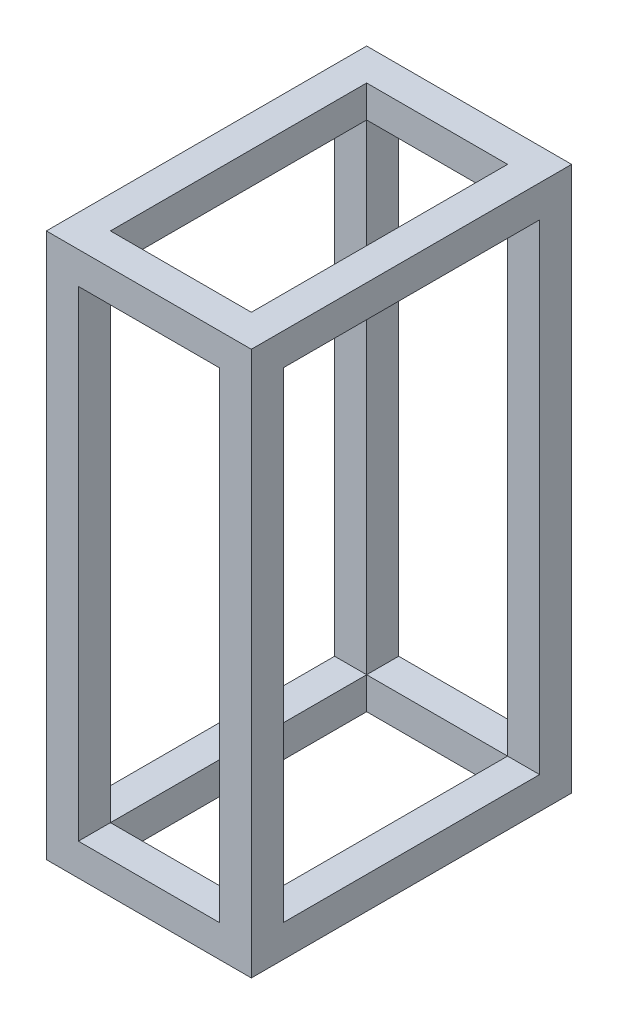
ISO-10303-21;
HEADER;
FILE_DESCRIPTION(('STEP AP214'),'2;1');
FILE_NAME('part.step','',(''),(''),'','','');
FILE_SCHEMA(('AUTOMOTIVE_DESIGN { 1 0 10303 214 1 1 1 1 }'));
ENDSEC;
DATA;
#1=APPLICATION_CONTEXT('core data for automotive mechanical design processes');
#2=APPLICATION_PROTOCOL_DEFINITION('international standard','automotive_design',2000,#1);
#3=PRODUCT_CONTEXT('',#1,'mechanical');
#4=PRODUCT('Part','Part','',(#3));
#5=PRODUCT_RELATED_PRODUCT_CATEGORY('part','',(#4));
#6=PRODUCT_DEFINITION_FORMATION('','',#4);
#7=PRODUCT_DEFINITION_CONTEXT('part definition',#1,'design');
#8=PRODUCT_DEFINITION('design','',#6,#7);
#9=PRODUCT_DEFINITION_SHAPE('','',#8);
#10=(LENGTH_UNIT() NAMED_UNIT(*) SI_UNIT(.MILLI.,.METRE.));
#11=(NAMED_UNIT(*) PLANE_ANGLE_UNIT() SI_UNIT($,.RADIAN.));
#12=(NAMED_UNIT(*) SI_UNIT($,.STERADIAN.) SOLID_ANGLE_UNIT());
#13=UNCERTAINTY_MEASURE_WITH_UNIT(LENGTH_MEASURE(1.E-05),#10,'distance_accuracy_value','');
#14=(GEOMETRIC_REPRESENTATION_CONTEXT(3) GLOBAL_UNCERTAINTY_ASSIGNED_CONTEXT((#13)) GLOBAL_UNIT_ASSIGNED_CONTEXT((#10,
#11,#12)) REPRESENTATION_CONTEXT('',''));
#15=CARTESIAN_POINT('',(0.,0.,0.));
#16=DIRECTION('',(0.,0.,1.));
#17=DIRECTION('',(1.,0.,0.));
#18=AXIS2_PLACEMENT_3D('',#15,#16,#17);
#19=CARTESIAN_POINT('',(0.,2.5,0.));
#20=DIRECTION('',(0.,-1.,0.));
#21=DIRECTION('',(0.,0.,-1.));
#22=AXIS2_PLACEMENT_3D('',#19,#20,#21);
#23=PLANE('',#22);
#24=DIRECTION('',(1.,0.,0.));
#25=VECTOR('',#24,1.);
#26=CARTESIAN_POINT('',(0.,2.5,-22.5));
#27=LINE('',#26,#25);
#28=CARTESIAN_POINT('',(-2.5,2.5,-22.5));
#29=VERTEX_POINT('',#28);
#30=CARTESIAN_POINT('',(0.,2.5,-22.5));
#31=VERTEX_POINT('',#30);
#32=EDGE_CURVE('E285',#29,#31,#27,.T.);
#33=ORIENTED_EDGE('',*,*,#32,.F.);
#34=DIRECTION('',(0.,0.,1.));
#35=VECTOR('',#34,1.);
#36=CARTESIAN_POINT('',(-2.5,2.5,0.));
#37=LINE('',#36,#35);
#38=CARTESIAN_POINT('',(-2.5,2.5,-2.5));
#39=VERTEX_POINT('',#38);
#40=EDGE_CURVE('E347',#29,#39,#37,.T.);
#41=ORIENTED_EDGE('',*,*,#40,.T.);
#42=DIRECTION('',(1.,0.,0.));
#43=VECTOR('',#42,1.);
#44=CARTESIAN_POINT('',(0.,2.5,-2.5));
#45=LINE('',#44,#43);
#46=CARTESIAN_POINT('',(0.,2.5,-2.5));
#47=VERTEX_POINT('',#46);
#48=EDGE_CURVE('E301',#39,#47,#45,.T.);
#49=ORIENTED_EDGE('',*,*,#48,.T.);
#50=DIRECTION('',(0.,0.,1.));
#51=VECTOR('',#50,1.);
#52=CARTESIAN_POINT('',(0.,2.5,-25.));
#53=LINE('',#52,#51);
#54=EDGE_CURVE('E382',#31,#47,#53,.T.);
#55=ORIENTED_EDGE('',*,*,#54,.F.);
#56=EDGE_LOOP('',(#33,#41,#49,#55));
#57=FACE_BOUND('',#56,.T.);
#58=ADVANCED_FACE('F59',(#57),#23,.F.);
#59=DIRECTION('',(0.,0.,1.));
#60=VECTOR('',#59,1.);
#61=CARTESIAN_POINT('',(-2.5,2.5,0.));
#62=LINE('',#61,#60);
#63=CARTESIAN_POINT('',(-2.5,2.5,0.));
#64=VERTEX_POINT('',#63);
#65=EDGE_CURVE('E304',#39,#64,#62,.T.);
#66=ORIENTED_EDGE('',*,*,#65,.F.);
#67=DIRECTION('',(-1.,0.,0.));
#68=VECTOR('',#67,1.);
#69=CARTESIAN_POINT('',(0.,2.5,-2.5));
#70=LINE('',#69,#68);
#71=CARTESIAN_POINT('',(-13.5,2.5,-2.5));
#72=VERTEX_POINT('',#71);
#73=EDGE_CURVE('E344',#39,#72,#70,.T.);
#74=ORIENTED_EDGE('',*,*,#73,.T.);
#75=DIRECTION('',(0.,0.,1.));
#76=VECTOR('',#75,1.);
#77=CARTESIAN_POINT('',(-13.5,2.5,0.));
#78=LINE('',#77,#76);
#79=CARTESIAN_POINT('',(-13.5,2.5,0.));
#80=VERTEX_POINT('',#79);
#81=EDGE_CURVE('E322',#72,#80,#78,.T.);
#82=ORIENTED_EDGE('',*,*,#81,.T.);
#83=DIRECTION('',(-1.,0.,0.));
#84=VECTOR('',#83,1.);
#85=CARTESIAN_POINT('',(0.,2.5,0.));
#86=LINE('',#85,#84);
#87=EDGE_CURVE('E375',#64,#80,#86,.T.);
#88=ORIENTED_EDGE('',*,*,#87,.F.);
#89=EDGE_LOOP('',(#66,#74,#82,#88));
#90=FACE_BOUND('',#89,.T.);
#91=ADVANCED_FACE('F469',(#90),#23,.F.);
#92=DIRECTION('',(-1.,0.,0.));
#93=VECTOR('',#92,1.);
#94=CARTESIAN_POINT('',(0.,2.5,-2.5));
#95=LINE('',#94,#93);
#96=CARTESIAN_POINT('',(-16.,2.5,-2.5));
#97=VERTEX_POINT('',#96);
#98=EDGE_CURVE('E320',#72,#97,#95,.T.);
#99=ORIENTED_EDGE('',*,*,#98,.F.);
#100=DIRECTION('',(0.,0.,-1.));
#101=VECTOR('',#100,1.);
#102=CARTESIAN_POINT('',(-13.5,2.5,0.));
#103=LINE('',#102,#101);
#104=CARTESIAN_POINT('',(-13.5,2.5,-22.5));
#105=VERTEX_POINT('',#104);
#106=EDGE_CURVE('E354',#72,#105,#103,.T.);
#107=ORIENTED_EDGE('',*,*,#106,.T.);
#108=DIRECTION('',(-1.,0.,0.));
#109=VECTOR('',#108,1.);
#110=CARTESIAN_POINT('',(0.,2.5,-22.5));
#111=LINE('',#110,#109);
#112=CARTESIAN_POINT('',(-16.,2.5,-22.5));
#113=VERTEX_POINT('',#112);
#114=EDGE_CURVE('E339',#105,#113,#111,.T.);
#115=ORIENTED_EDGE('',*,*,#114,.T.);
#116=DIRECTION('',(0.,0.,-1.));
#117=VECTOR('',#116,1.);
#118=CARTESIAN_POINT('',(-16.,2.5,0.));
#119=LINE('',#118,#117);
#120=EDGE_CURVE('E377',#97,#113,#119,.T.);
#121=ORIENTED_EDGE('',*,*,#120,.F.);
#122=EDGE_LOOP('',(#99,#107,#115,#121));
#123=FACE_BOUND('',#122,.T.);
#124=ADVANCED_FACE('F452',(#123),#23,.F.);
#125=CARTESIAN_POINT('',(0.,2.5,0.));
#126=DIRECTION('',(0.,0.,1.));
#127=DIRECTION('',(1.,0.,0.));
#128=AXIS2_PLACEMENT_3D('',#125,#126,#127);
#129=PLANE('',#128);
#130=DIRECTION('',(-1.,0.,0.));
#131=VECTOR('',#130,1.);
#132=CARTESIAN_POINT('',(0.,42.5,0.));
#133=LINE('',#132,#131);
#134=CARTESIAN_POINT('',(0.,42.5,0.));
#135=VERTEX_POINT('',#134);
#136=CARTESIAN_POINT('',(-16.,42.5,0.));
#137=VERTEX_POINT('',#136);
#138=EDGE_CURVE('E223',#135,#137,#133,.T.);
#139=ORIENTED_EDGE('',*,*,#138,.T.);
#140=DIRECTION('',(0.,-1.,0.));
#141=VECTOR('',#140,1.);
#142=CARTESIAN_POINT('',(-16.,2.5,0.));
#143=LINE('',#142,#141);
#144=CARTESIAN_POINT('',(-16.,0.,0.));
#145=VERTEX_POINT('',#144);
#146=EDGE_CURVE('E63',#137,#145,#143,.T.);
#147=ORIENTED_EDGE('',*,*,#146,.T.);
#148=DIRECTION('',(-1.,0.,0.));
#149=VECTOR('',#148,1.);
#150=CARTESIAN_POINT('',(0.,0.,0.));
#151=LINE('',#150,#149);
#152=CARTESIAN_POINT('',(0.,0.,0.));
#153=VERTEX_POINT('',#152);
#154=EDGE_CURVE('E374',#153,#145,#151,.T.);
#155=ORIENTED_EDGE('',*,*,#154,.F.);
#156=DIRECTION('',(0.,-1.,0.));
#157=VECTOR('',#156,1.);
#158=CARTESIAN_POINT('',(0.,2.5,0.));
#159=LINE('',#158,#157);
#160=EDGE_CURVE('E12',#135,#153,#159,.T.);
#161=ORIENTED_EDGE('',*,*,#160,.F.);
#162=EDGE_LOOP('',(#139,#147,#155,#161));
#163=FACE_BOUND('',#162,.T.);
#164=DIRECTION('',(0.,-1.,0.));
#165=VECTOR('',#164,1.);
#166=CARTESIAN_POINT('',(-2.5,40.,0.));
#167=LINE('',#166,#165);
#168=CARTESIAN_POINT('',(-2.5,40.,0.));
#169=VERTEX_POINT('',#168);
#170=EDGE_CURVE('E295',#169,#64,#167,.T.);
#171=ORIENTED_EDGE('',*,*,#170,.T.);
#172=ORIENTED_EDGE('',*,*,#87,.T.);
#173=DIRECTION('',(0.,-1.,0.));
#174=VECTOR('',#173,1.);
#175=CARTESIAN_POINT('',(-13.5,40.,0.));
#176=LINE('',#175,#174);
#177=CARTESIAN_POINT('',(-13.5,40.,0.));
#178=VERTEX_POINT('',#177);
#179=EDGE_CURVE('E311',#178,#80,#176,.T.);
#180=ORIENTED_EDGE('',*,*,#179,.F.);
#181=DIRECTION('',(-1.,0.,0.));
#182=VECTOR('',#181,1.);
#183=CARTESIAN_POINT('',(0.,40.,0.));
#184=LINE('',#183,#182);
#185=EDGE_CURVE('E242',#169,#178,#184,.T.);
#186=ORIENTED_EDGE('',*,*,#185,.F.);
#187=EDGE_LOOP('',(#171,#172,#180,#186));
#188=FACE_BOUND('',#187,.T.);
#189=ADVANCED_FACE('F61',(#163,#188),#129,.T.);
#190=CARTESIAN_POINT('',(0.,2.5,-25.));
#191=DIRECTION('',(1.,0.,0.));
#192=DIRECTION('',(0.,0.,-1.));
#193=AXIS2_PLACEMENT_3D('',#190,#191,#192);
#194=PLANE('',#193);
#195=DIRECTION('',(0.,0.,1.));
#196=VECTOR('',#195,1.);
#197=CARTESIAN_POINT('',(0.,42.5,0.));
#198=LINE('',#197,#196);
#199=CARTESIAN_POINT('',(0.,42.5,-25.));
#200=VERTEX_POINT('',#199);
#201=EDGE_CURVE('E217',#200,#135,#198,.T.);
#202=ORIENTED_EDGE('',*,*,#201,.T.);
#203=ORIENTED_EDGE('',*,*,#160,.T.);
#204=DIRECTION('',(0.,0.,1.));
#205=VECTOR('',#204,1.);
#206=CARTESIAN_POINT('',(0.,0.,-25.));
#207=LINE('',#206,#205);
#208=CARTESIAN_POINT('',(0.,0.,-25.));
#209=VERTEX_POINT('',#208);
#210=EDGE_CURVE('E84',#209,#153,#207,.T.);
#211=ORIENTED_EDGE('',*,*,#210,.F.);
#212=DIRECTION('',(0.,-1.,0.));
#213=VECTOR('',#212,1.);
#214=CARTESIAN_POINT('',(0.,2.5,-25.));
#215=LINE('',#214,#213);
#216=EDGE_CURVE('E68',#200,#209,#215,.T.);
#217=ORIENTED_EDGE('',*,*,#216,.F.);
#218=EDGE_LOOP('',(#202,#203,#211,#217));
#219=FACE_BOUND('',#218,.T.);
#220=DIRECTION('',(0.,-1.,0.));
#221=VECTOR('',#220,1.);
#222=CARTESIAN_POINT('',(0.,40.,-22.5));
#223=LINE('',#222,#221);
#224=CARTESIAN_POINT('',(0.,40.,-22.5));
#225=VERTEX_POINT('',#224);
#226=EDGE_CURVE('E276',#225,#31,#223,.T.);
#227=ORIENTED_EDGE('',*,*,#226,.T.);
#228=ORIENTED_EDGE('',*,*,#54,.T.);
#229=DIRECTION('',(0.,-1.,0.));
#230=VECTOR('',#229,1.);
#231=CARTESIAN_POINT('',(0.,40.,-2.5));
#232=LINE('',#231,#230);
#233=CARTESIAN_POINT('',(0.,40.,-2.5));
#234=VERTEX_POINT('',#233);
#235=EDGE_CURVE('E292',#234,#47,#232,.T.);
#236=ORIENTED_EDGE('',*,*,#235,.F.);
#237=DIRECTION('',(0.,0.,1.));
#238=VECTOR('',#237,1.);
#239=CARTESIAN_POINT('',(0.,40.,0.));
#240=LINE('',#239,#238);
#241=EDGE_CURVE('E244',#225,#234,#240,.T.);
#242=ORIENTED_EDGE('',*,*,#241,.F.);
#243=EDGE_LOOP('',(#227,#228,#236,#242));
#244=FACE_BOUND('',#243,.T.);
#245=ADVANCED_FACE('F390',(#219,#244),#194,.T.);
#246=CARTESIAN_POINT('',(-16.,2.5,-25.));
#247=DIRECTION('',(0.,0.,-1.));
#248=DIRECTION('',(-1.,0.,0.));
#249=AXIS2_PLACEMENT_3D('',#246,#247,#248);
#250=PLANE('',#249);
#251=DIRECTION('',(1.,0.,0.));
#252=VECTOR('',#251,1.);
#253=CARTESIAN_POINT('',(0.,40.,-25.));
#254=LINE('',#253,#252);
#255=CARTESIAN_POINT('',(-13.5,40.,-25.));
#256=VERTEX_POINT('',#255);
#257=CARTESIAN_POINT('',(-2.5,40.,-25.));
#258=VERTEX_POINT('',#257);
#259=EDGE_CURVE('E238',#256,#258,#254,.T.);
#260=ORIENTED_EDGE('',*,*,#259,.F.);
#261=DIRECTION('',(0.,-1.,0.));
#262=VECTOR('',#261,1.);
#263=CARTESIAN_POINT('',(-13.5,40.,-25.));
#264=LINE('',#263,#262);
#265=CARTESIAN_POINT('',(-13.5,2.5,-25.));
#266=VERTEX_POINT('',#265);
#267=EDGE_CURVE('E333',#256,#266,#264,.T.);
#268=ORIENTED_EDGE('',*,*,#267,.T.);
#269=DIRECTION('',(1.,0.,0.));
#270=VECTOR('',#269,1.);
#271=CARTESIAN_POINT('',(-16.,2.5,-25.));
#272=LINE('',#271,#270);
#273=CARTESIAN_POINT('',(-2.5,2.5,-25.));
#274=VERTEX_POINT('',#273);
#275=EDGE_CURVE('E379',#266,#274,#272,.T.);
#276=ORIENTED_EDGE('',*,*,#275,.T.);
#277=DIRECTION('',(0.,-1.,0.));
#278=VECTOR('',#277,1.);
#279=CARTESIAN_POINT('',(-2.5,40.,-25.));
#280=LINE('',#279,#278);
#281=EDGE_CURVE('E274',#258,#274,#280,.T.);
#282=ORIENTED_EDGE('',*,*,#281,.F.);
#283=EDGE_LOOP('',(#260,#268,#276,#282));
#284=FACE_BOUND('',#283,.T.);
#285=DIRECTION('',(0.,-1.,0.));
#286=VECTOR('',#285,1.);
#287=CARTESIAN_POINT('',(-16.,2.5,-25.));
#288=LINE('',#287,#286);
#289=CARTESIAN_POINT('',(-16.,42.5,-25.));
#290=VERTEX_POINT('',#289);
#291=CARTESIAN_POINT('',(-16.,0.,-25.));
#292=VERTEX_POINT('',#291);
#293=EDGE_CURVE('E199',#290,#292,#288,.T.);
#294=ORIENTED_EDGE('',*,*,#293,.F.);
#295=DIRECTION('',(1.,0.,0.));
#296=VECTOR('',#295,1.);
#297=CARTESIAN_POINT('',(0.,42.5,-25.));
#298=LINE('',#297,#296);
#299=EDGE_CURVE('E203',#290,#200,#298,.T.);
#300=ORIENTED_EDGE('',*,*,#299,.T.);
#301=ORIENTED_EDGE('',*,*,#216,.T.);
#302=DIRECTION('',(1.,0.,0.));
#303=VECTOR('',#302,1.);
#304=CARTESIAN_POINT('',(-16.,0.,-25.));
#305=LINE('',#304,#303);
#306=EDGE_CURVE('E205',#292,#209,#305,.T.);
#307=ORIENTED_EDGE('',*,*,#306,.F.);
#308=EDGE_LOOP('',(#294,#300,#301,#307));
#309=FACE_BOUND('',#308,.T.);
#310=ADVANCED_FACE('F201',(#284,#309),#250,.T.);
#311=CARTESIAN_POINT('',(-16.,2.5,0.));
#312=DIRECTION('',(-1.,0.,0.));
#313=DIRECTION('',(0.,0.,1.));
#314=AXIS2_PLACEMENT_3D('',#311,#312,#313);
#315=PLANE('',#314);
#316=DIRECTION('',(0.,0.,-1.));
#317=VECTOR('',#316,1.);
#318=CARTESIAN_POINT('',(-16.,42.5,0.));
#319=LINE('',#318,#317);
#320=EDGE_CURVE('E214',#137,#290,#319,.T.);
#321=ORIENTED_EDGE('',*,*,#320,.T.);
#322=ORIENTED_EDGE('',*,*,#293,.T.);
#323=DIRECTION('',(0.,0.,-1.));
#324=VECTOR('',#323,1.);
#325=CARTESIAN_POINT('',(-16.,0.,0.));
#326=LINE('',#325,#324);
#327=EDGE_CURVE('E385',#145,#292,#326,.T.);
#328=ORIENTED_EDGE('',*,*,#327,.F.);
#329=ORIENTED_EDGE('',*,*,#146,.F.);
#330=EDGE_LOOP('',(#321,#322,#328,#329));
#331=FACE_BOUND('',#330,.T.);
#332=DIRECTION('',(0.,-1.,0.));
#333=VECTOR('',#332,1.);
#334=CARTESIAN_POINT('',(-16.,40.,-2.5));
#335=LINE('',#334,#333);
#336=CARTESIAN_POINT('',(-16.,40.,-2.5));
#337=VERTEX_POINT('',#336);
#338=EDGE_CURVE('E314',#337,#97,#335,.T.);
#339=ORIENTED_EDGE('',*,*,#338,.T.);
#340=ORIENTED_EDGE('',*,*,#120,.T.);
#341=DIRECTION('',(0.,-1.,0.));
#342=VECTOR('',#341,1.);
#343=CARTESIAN_POINT('',(-16.,40.,-22.5));
#344=LINE('',#343,#342);
#345=CARTESIAN_POINT('',(-16.,40.,-22.5));
#346=VERTEX_POINT('',#345);
#347=EDGE_CURVE('E330',#346,#113,#344,.T.);
#348=ORIENTED_EDGE('',*,*,#347,.F.);
#349=DIRECTION('',(0.,0.,-1.));
#350=VECTOR('',#349,1.);
#351=CARTESIAN_POINT('',(-16.,40.,0.));
#352=LINE('',#351,#350);
#353=EDGE_CURVE('E240',#337,#346,#352,.T.);
#354=ORIENTED_EDGE('',*,*,#353,.F.);
#355=EDGE_LOOP('',(#339,#340,#348,#354));
#356=FACE_BOUND('',#355,.T.);
#357=ADVANCED_FACE('F220',(#331,#356),#315,.T.);
#358=DIRECTION('',(1.,0.,0.));
#359=VECTOR('',#358,1.);
#360=CARTESIAN_POINT('',(0.,2.5,-22.5));
#361=LINE('',#360,#359);
#362=EDGE_CURVE('E351',#105,#29,#361,.T.);
#363=ORIENTED_EDGE('',*,*,#362,.T.);
#364=DIRECTION('',(0.,0.,-1.));
#365=VECTOR('',#364,1.);
#366=CARTESIAN_POINT('',(-2.50000000000002,2.5,0.));
#367=LINE('',#366,#365);
#368=EDGE_CURVE('E282',#29,#274,#367,.T.);
#369=ORIENTED_EDGE('',*,*,#368,.T.);
#370=ORIENTED_EDGE('',*,*,#275,.F.);
#371=DIRECTION('',(0.,0.,-1.));
#372=VECTOR('',#371,1.);
#373=CARTESIAN_POINT('',(-13.5,2.5,0.));
#374=LINE('',#373,#372);
#375=EDGE_CURVE('E342',#105,#266,#374,.T.);
#376=ORIENTED_EDGE('',*,*,#375,.F.);
#377=EDGE_LOOP('',(#363,#369,#370,#376));
#378=FACE_BOUND('',#377,.T.);
#379=ADVANCED_FACE('F399',(#378),#23,.F.);
#380=CARTESIAN_POINT('',(0.,0.,0.));
#381=DIRECTION('',(0.,-1.,0.));
#382=DIRECTION('',(0.,0.,-1.));
#383=AXIS2_PLACEMENT_3D('',#380,#381,#382);
#384=PLANE('',#383);
#385=ORIENTED_EDGE('',*,*,#306,.T.);
#386=ORIENTED_EDGE('',*,*,#210,.T.);
#387=ORIENTED_EDGE('',*,*,#154,.T.);
#388=ORIENTED_EDGE('',*,*,#327,.T.);
#389=EDGE_LOOP('',(#385,#386,#387,#388));
#390=FACE_BOUND('',#389,.T.);
#391=DIRECTION('',(0.,0.,1.));
#392=VECTOR('',#391,1.);
#393=CARTESIAN_POINT('',(-2.5,0.,0.));
#394=LINE('',#393,#392);
#395=CARTESIAN_POINT('',(-2.5,0.,-22.5));
#396=VERTEX_POINT('',#395);
#397=CARTESIAN_POINT('',(-2.5,0.,-2.5));
#398=VERTEX_POINT('',#397);
#399=EDGE_CURVE('E359',#396,#398,#394,.T.);
#400=ORIENTED_EDGE('',*,*,#399,.F.);
#401=DIRECTION('',(1.,0.,0.));
#402=VECTOR('',#401,1.);
#403=CARTESIAN_POINT('',(0.,0.,-22.5));
#404=LINE('',#403,#402);
#405=CARTESIAN_POINT('',(-13.5,0.,-22.5));
#406=VERTEX_POINT('',#405);
#407=EDGE_CURVE('E362',#406,#396,#404,.T.);
#408=ORIENTED_EDGE('',*,*,#407,.F.);
#409=DIRECTION('',(0.,0.,-1.));
#410=VECTOR('',#409,1.);
#411=CARTESIAN_POINT('',(-13.5,0.,0.));
#412=LINE('',#411,#410);
#413=CARTESIAN_POINT('',(-13.5,0.,-2.5));
#414=VERTEX_POINT('',#413);
#415=EDGE_CURVE('E348',#414,#406,#412,.T.);
#416=ORIENTED_EDGE('',*,*,#415,.F.);
#417=DIRECTION('',(-1.,0.,0.));
#418=VECTOR('',#417,1.);
#419=CARTESIAN_POINT('',(0.,0.,-2.5));
#420=LINE('',#419,#418);
#421=EDGE_CURVE('E76',#398,#414,#420,.T.);
#422=ORIENTED_EDGE('',*,*,#421,.F.);
#423=EDGE_LOOP('',(#400,#408,#416,#422));
#424=FACE_BOUND('',#423,.T.);
#425=ADVANCED_FACE('F395',(#390,#424),#384,.T.);
#426=CARTESIAN_POINT('',(0.,2.5,-2.5));
#427=DIRECTION('',(0.,0.,1.));
#428=DIRECTION('',(1.,0.,0.));
#429=AXIS2_PLACEMENT_3D('',#426,#427,#428);
#430=PLANE('',#429);
#431=ORIENTED_EDGE('',*,*,#421,.T.);
#432=DIRECTION('',(0.,-1.,0.));
#433=VECTOR('',#432,1.);
#434=CARTESIAN_POINT('',(-13.5,2.5,-2.5));
#435=LINE('',#434,#433);
#436=EDGE_CURVE('E357',#72,#414,#435,.T.);
#437=ORIENTED_EDGE('',*,*,#436,.F.);
#438=ORIENTED_EDGE('',*,*,#73,.F.);
#439=DIRECTION('',(0.,-1.,0.));
#440=VECTOR('',#439,1.);
#441=CARTESIAN_POINT('',(-2.5,2.5,-2.5));
#442=LINE('',#441,#440);
#443=EDGE_CURVE('E372',#39,#398,#442,.T.);
#444=ORIENTED_EDGE('',*,*,#443,.T.);
#445=EDGE_LOOP('',(#431,#437,#438,#444));
#446=FACE_BOUND('',#445,.T.);
#447=ADVANCED_FACE('F398',(#446),#430,.F.);
#448=CARTESIAN_POINT('',(-2.5,2.5,0.));
#449=DIRECTION('',(1.,0.,0.));
#450=DIRECTION('',(0.,0.,-1.));
#451=AXIS2_PLACEMENT_3D('',#448,#449,#450);
#452=PLANE('',#451);
#453=ORIENTED_EDGE('',*,*,#399,.T.);
#454=ORIENTED_EDGE('',*,*,#443,.F.);
#455=ORIENTED_EDGE('',*,*,#40,.F.);
#456=DIRECTION('',(0.,-1.,0.));
#457=VECTOR('',#456,1.);
#458=CARTESIAN_POINT('',(-2.5,2.5,-22.5));
#459=LINE('',#458,#457);
#460=EDGE_CURVE('E370',#29,#396,#459,.T.);
#461=ORIENTED_EDGE('',*,*,#460,.T.);
#462=EDGE_LOOP('',(#453,#454,#455,#461));
#463=FACE_BOUND('',#462,.T.);
#464=ADVANCED_FACE('F406',(#463),#452,.F.);
#465=CARTESIAN_POINT('',(0.,2.5,-22.5));
#466=DIRECTION('',(0.,0.,-1.));
#467=DIRECTION('',(-1.,0.,0.));
#468=AXIS2_PLACEMENT_3D('',#465,#466,#467);
#469=PLANE('',#468);
#470=ORIENTED_EDGE('',*,*,#407,.T.);
#471=ORIENTED_EDGE('',*,*,#460,.F.);
#472=ORIENTED_EDGE('',*,*,#362,.F.);
#473=DIRECTION('',(0.,-1.,0.));
#474=VECTOR('',#473,1.);
#475=CARTESIAN_POINT('',(-13.5,2.5,-22.5));
#476=LINE('',#475,#474);
#477=EDGE_CURVE('E368',#105,#406,#476,.T.);
#478=ORIENTED_EDGE('',*,*,#477,.T.);
#479=EDGE_LOOP('',(#470,#471,#472,#478));
#480=FACE_BOUND('',#479,.T.);
#481=ADVANCED_FACE('F412',(#480),#469,.F.);
#482=CARTESIAN_POINT('',(-13.5,2.5,0.));
#483=DIRECTION('',(-1.,0.,0.));
#484=DIRECTION('',(0.,0.,1.));
#485=AXIS2_PLACEMENT_3D('',#482,#483,#484);
#486=PLANE('',#485);
#487=ORIENTED_EDGE('',*,*,#415,.T.);
#488=ORIENTED_EDGE('',*,*,#477,.F.);
#489=ORIENTED_EDGE('',*,*,#106,.F.);
#490=ORIENTED_EDGE('',*,*,#436,.T.);
#491=EDGE_LOOP('',(#487,#488,#489,#490));
#492=FACE_BOUND('',#491,.T.);
#493=ADVANCED_FACE('F416',(#492),#486,.F.);
#494=CARTESIAN_POINT('',(-13.5,40.,0.));
#495=DIRECTION('',(-1.,0.,0.));
#496=DIRECTION('',(0.,0.,1.));
#497=AXIS2_PLACEMENT_3D('',#494,#495,#496);
#498=PLANE('',#497);
#499=DIRECTION('',(0.,-1.,0.));
#500=VECTOR('',#499,1.);
#501=CARTESIAN_POINT('',(-13.5,40.,-22.5));
#502=LINE('',#501,#500);
#503=CARTESIAN_POINT('',(-13.5,40.,-22.5));
#504=VERTEX_POINT('',#503);
#505=EDGE_CURVE('E336',#504,#105,#502,.T.);
#506=ORIENTED_EDGE('',*,*,#505,.T.);
#507=ORIENTED_EDGE('',*,*,#375,.T.);
#508=ORIENTED_EDGE('',*,*,#267,.F.);
#509=DIRECTION('',(0.,0.,-1.));
#510=VECTOR('',#509,1.);
#511=CARTESIAN_POINT('',(-13.5,40.,0.));
#512=LINE('',#511,#510);
#513=EDGE_CURVE('E328',#504,#256,#512,.T.);
#514=ORIENTED_EDGE('',*,*,#513,.F.);
#515=EDGE_LOOP('',(#506,#507,#508,#514));
#516=FACE_BOUND('',#515,.T.);
#517=ADVANCED_FACE('F444',(#516),#498,.F.);
#518=CARTESIAN_POINT('',(0.,40.,-22.5));
#519=DIRECTION('',(0.,0.,1.));
#520=DIRECTION('',(1.,0.,0.));
#521=AXIS2_PLACEMENT_3D('',#518,#519,#520);
#522=PLANE('',#521);
#523=ORIENTED_EDGE('',*,*,#114,.F.);
#524=ORIENTED_EDGE('',*,*,#505,.F.);
#525=DIRECTION('',(-1.,0.,0.));
#526=VECTOR('',#525,1.);
#527=CARTESIAN_POINT('',(0.,40.,-22.5));
#528=LINE('',#527,#526);
#529=EDGE_CURVE('E325',#504,#346,#528,.T.);
#530=ORIENTED_EDGE('',*,*,#529,.T.);
#531=ORIENTED_EDGE('',*,*,#347,.T.);
#532=EDGE_LOOP('',(#523,#524,#530,#531));
#533=FACE_BOUND('',#532,.T.);
#534=ADVANCED_FACE('F447',(#533),#522,.T.);
#535=CARTESIAN_POINT('',(-13.5,40.,0.));
#536=DIRECTION('',(1.,0.,0.));
#537=DIRECTION('',(0.,0.,-1.));
#538=AXIS2_PLACEMENT_3D('',#535,#536,#537);
#539=PLANE('',#538);
#540=ORIENTED_EDGE('',*,*,#81,.F.);
#541=DIRECTION('',(0.,-1.,0.));
#542=VECTOR('',#541,1.);
#543=CARTESIAN_POINT('',(-13.5,40.,-2.5));
#544=LINE('',#543,#542);
#545=CARTESIAN_POINT('',(-13.5,40.,-2.5));
#546=VERTEX_POINT('',#545);
#547=EDGE_CURVE('E317',#546,#72,#544,.T.);
#548=ORIENTED_EDGE('',*,*,#547,.F.);
#549=DIRECTION('',(0.,0.,1.));
#550=VECTOR('',#549,1.);
#551=CARTESIAN_POINT('',(-13.5,40.,0.));
#552=LINE('',#551,#550);
#553=EDGE_CURVE('E306',#546,#178,#552,.T.);
#554=ORIENTED_EDGE('',*,*,#553,.T.);
#555=ORIENTED_EDGE('',*,*,#179,.T.);
#556=EDGE_LOOP('',(#540,#548,#554,#555));
#557=FACE_BOUND('',#556,.T.);
#558=ADVANCED_FACE('F466',(#557),#539,.T.);
#559=CARTESIAN_POINT('',(0.,40.,-2.5));
#560=DIRECTION('',(0.,0.,1.));
#561=DIRECTION('',(1.,0.,0.));
#562=AXIS2_PLACEMENT_3D('',#559,#560,#561);
#563=PLANE('',#562);
#564=ORIENTED_EDGE('',*,*,#547,.T.);
#565=ORIENTED_EDGE('',*,*,#98,.T.);
#566=ORIENTED_EDGE('',*,*,#338,.F.);
#567=DIRECTION('',(-1.,0.,0.));
#568=VECTOR('',#567,1.);
#569=CARTESIAN_POINT('',(0.,40.,-2.5));
#570=LINE('',#569,#568);
#571=EDGE_CURVE('E309',#546,#337,#570,.T.);
#572=ORIENTED_EDGE('',*,*,#571,.F.);
#573=EDGE_LOOP('',(#564,#565,#566,#572));
#574=FACE_BOUND('',#573,.T.);
#575=ADVANCED_FACE('F455',(#574),#563,.F.);
#576=CARTESIAN_POINT('',(-2.5,40.,0.));
#577=DIRECTION('',(1.,0.,0.));
#578=DIRECTION('',(0.,0.,-1.));
#579=AXIS2_PLACEMENT_3D('',#576,#577,#578);
#580=PLANE('',#579);
#581=DIRECTION('',(0.,-1.,0.));
#582=VECTOR('',#581,1.);
#583=CARTESIAN_POINT('',(-2.5,40.,-2.5));
#584=LINE('',#583,#582);
#585=CARTESIAN_POINT('',(-2.5,40.,-2.5));
#586=VERTEX_POINT('',#585);
#587=EDGE_CURVE('E298',#586,#39,#584,.T.);
#588=ORIENTED_EDGE('',*,*,#587,.T.);
#589=ORIENTED_EDGE('',*,*,#65,.T.);
#590=ORIENTED_EDGE('',*,*,#170,.F.);
#591=DIRECTION('',(0.,0.,1.));
#592=VECTOR('',#591,1.);
#593=CARTESIAN_POINT('',(-2.5,40.,0.));
#594=LINE('',#593,#592);
#595=EDGE_CURVE('E290',#586,#169,#594,.T.);
#596=ORIENTED_EDGE('',*,*,#595,.F.);
#597=EDGE_LOOP('',(#588,#589,#590,#596));
#598=FACE_BOUND('',#597,.T.);
#599=ADVANCED_FACE('F474',(#598),#580,.F.);
#600=CARTESIAN_POINT('',(0.,40.,-2.5));
#601=DIRECTION('',(0.,0.,-1.));
#602=DIRECTION('',(-1.,0.,0.));
#603=AXIS2_PLACEMENT_3D('',#600,#601,#602);
#604=PLANE('',#603);
#605=ORIENTED_EDGE('',*,*,#48,.F.);
#606=ORIENTED_EDGE('',*,*,#587,.F.);
#607=DIRECTION('',(1.,0.,0.));
#608=VECTOR('',#607,1.);
#609=CARTESIAN_POINT('',(0.,40.,-2.5));
#610=LINE('',#609,#608);
#611=EDGE_CURVE('E287',#586,#234,#610,.T.);
#612=ORIENTED_EDGE('',*,*,#611,.T.);
#613=ORIENTED_EDGE('',*,*,#235,.T.);
#614=EDGE_LOOP('',(#605,#606,#612,#613));
#615=FACE_BOUND('',#614,.T.);
#616=ADVANCED_FACE('F477',(#615),#604,.T.);
#617=CARTESIAN_POINT('',(0.,40.,-22.5));
#618=DIRECTION('',(0.,0.,-1.));
#619=DIRECTION('',(-1.,0.,0.));
#620=AXIS2_PLACEMENT_3D('',#617,#618,#619);
#621=PLANE('',#620);
#622=DIRECTION('',(0.,-1.,0.));
#623=VECTOR('',#622,1.);
#624=CARTESIAN_POINT('',(-2.5,40.,-22.5));
#625=LINE('',#624,#623);
#626=CARTESIAN_POINT('',(-2.5,40.,-22.5));
#627=VERTEX_POINT('',#626);
#628=EDGE_CURVE('E279',#627,#29,#625,.T.);
#629=ORIENTED_EDGE('',*,*,#628,.T.);
#630=ORIENTED_EDGE('',*,*,#32,.T.);
#631=ORIENTED_EDGE('',*,*,#226,.F.);
#632=DIRECTION('',(1.,0.,0.));
#633=VECTOR('',#632,1.);
#634=CARTESIAN_POINT('',(0.,40.,-22.5));
#635=LINE('',#634,#633);
#636=EDGE_CURVE('E271',#627,#225,#635,.T.);
#637=ORIENTED_EDGE('',*,*,#636,.F.);
#638=EDGE_LOOP('',(#629,#630,#631,#637));
#639=FACE_BOUND('',#638,.T.);
#640=ADVANCED_FACE('F424',(#639),#621,.F.);
#641=CARTESIAN_POINT('',(-2.50000000000002,40.,0.));
#642=DIRECTION('',(-1.,0.,0.));
#643=DIRECTION('',(0.,0.,1.));
#644=AXIS2_PLACEMENT_3D('',#641,#642,#643);
#645=PLANE('',#644);
#646=ORIENTED_EDGE('',*,*,#368,.F.);
#647=ORIENTED_EDGE('',*,*,#628,.F.);
#648=DIRECTION('',(0.,0.,-1.));
#649=VECTOR('',#648,1.);
#650=CARTESIAN_POINT('',(-2.50000000000002,40.,0.));
#651=LINE('',#650,#649);
#652=EDGE_CURVE('E268',#627,#258,#651,.T.);
#653=ORIENTED_EDGE('',*,*,#652,.T.);
#654=ORIENTED_EDGE('',*,*,#281,.T.);
#655=EDGE_LOOP('',(#646,#647,#653,#654));
#656=FACE_BOUND('',#655,.T.);
#657=ADVANCED_FACE('F434',(#656),#645,.T.);
#658=CARTESIAN_POINT('',(0.,40.,0.));
#659=DIRECTION('',(0.,1.,0.));
#660=DIRECTION('',(0.,0.,1.));
#661=AXIS2_PLACEMENT_3D('',#658,#659,#660);
#662=PLANE('',#661);
#663=DIRECTION('',(1.,0.,0.));
#664=VECTOR('',#663,1.);
#665=CARTESIAN_POINT('',(0.,40.,-22.5));
#666=LINE('',#665,#664);
#667=EDGE_CURVE('E249',#504,#627,#666,.T.);
#668=ORIENTED_EDGE('',*,*,#667,.F.);
#669=ORIENTED_EDGE('',*,*,#513,.T.);
#670=ORIENTED_EDGE('',*,*,#259,.T.);
#671=ORIENTED_EDGE('',*,*,#652,.F.);
#672=EDGE_LOOP('',(#668,#669,#670,#671));
#673=FACE_BOUND('',#672,.T.);
#674=ADVANCED_FACE('F574',(#673),#662,.F.);
#675=ORIENTED_EDGE('',*,*,#529,.F.);
#676=DIRECTION('',(0.,0.,-1.));
#677=VECTOR('',#676,1.);
#678=CARTESIAN_POINT('',(-13.5,40.,0.));
#679=LINE('',#678,#677);
#680=EDGE_CURVE('E246',#546,#504,#679,.T.);
#681=ORIENTED_EDGE('',*,*,#680,.F.);
#682=ORIENTED_EDGE('',*,*,#571,.T.);
#683=ORIENTED_EDGE('',*,*,#353,.T.);
#684=EDGE_LOOP('',(#675,#681,#682,#683));
#685=FACE_BOUND('',#684,.T.);
#686=ADVANCED_FACE('F460',(#685),#662,.F.);
#687=ORIENTED_EDGE('',*,*,#553,.F.);
#688=DIRECTION('',(-1.,0.,0.));
#689=VECTOR('',#688,1.);
#690=CARTESIAN_POINT('',(0.,40.,-2.5));
#691=LINE('',#690,#689);
#692=EDGE_CURVE('E218',#586,#546,#691,.T.);
#693=ORIENTED_EDGE('',*,*,#692,.F.);
#694=ORIENTED_EDGE('',*,*,#595,.T.);
#695=ORIENTED_EDGE('',*,*,#185,.T.);
#696=EDGE_LOOP('',(#687,#693,#694,#695));
#697=FACE_BOUND('',#696,.T.);
#698=ADVANCED_FACE('F595',(#697),#662,.F.);
#699=ORIENTED_EDGE('',*,*,#611,.F.);
#700=DIRECTION('',(0.,0.,1.));
#701=VECTOR('',#700,1.);
#702=CARTESIAN_POINT('',(-2.5,40.,0.));
#703=LINE('',#702,#701);
#704=EDGE_CURVE('E252',#627,#586,#703,.T.);
#705=ORIENTED_EDGE('',*,*,#704,.F.);
#706=ORIENTED_EDGE('',*,*,#636,.T.);
#707=ORIENTED_EDGE('',*,*,#241,.T.);
#708=EDGE_LOOP('',(#699,#705,#706,#707));
#709=FACE_BOUND('',#708,.T.);
#710=ADVANCED_FACE('F430',(#709),#662,.F.);
#711=CARTESIAN_POINT('',(-13.5,42.5,0.));
#712=DIRECTION('',(-1.,0.,0.));
#713=DIRECTION('',(0.,0.,1.));
#714=AXIS2_PLACEMENT_3D('',#711,#712,#713);
#715=PLANE('',#714);
#716=ORIENTED_EDGE('',*,*,#680,.T.);
#717=DIRECTION('',(0.,-1.,0.));
#718=VECTOR('',#717,1.);
#719=CARTESIAN_POINT('',(-13.5,42.5,-22.5));
#720=LINE('',#719,#718);
#721=CARTESIAN_POINT('',(-13.5,42.5,-22.5));
#722=VERTEX_POINT('',#721);
#723=EDGE_CURVE('E265',#722,#504,#720,.T.);
#724=ORIENTED_EDGE('',*,*,#723,.F.);
#725=DIRECTION('',(0.,0.,-1.));
#726=VECTOR('',#725,1.);
#727=CARTESIAN_POINT('',(-13.5,42.5,0.));
#728=LINE('',#727,#726);
#729=CARTESIAN_POINT('',(-13.5,42.5,-2.5));
#730=VERTEX_POINT('',#729);
#731=EDGE_CURVE('E228',#730,#722,#728,.T.);
#732=ORIENTED_EDGE('',*,*,#731,.F.);
#733=DIRECTION('',(0.,-1.,0.));
#734=VECTOR('',#733,1.);
#735=CARTESIAN_POINT('',(-13.5,42.5,-2.5));
#736=LINE('',#735,#734);
#737=EDGE_CURVE('E237',#730,#546,#736,.T.);
#738=ORIENTED_EDGE('',*,*,#737,.T.);
#739=EDGE_LOOP('',(#716,#724,#732,#738));
#740=FACE_BOUND('',#739,.T.);
#741=ADVANCED_FACE('F615',(#740),#715,.F.);
#742=CARTESIAN_POINT('',(0.,42.5,-22.5));
#743=DIRECTION('',(0.,0.,-1.));
#744=DIRECTION('',(-1.,0.,0.));
#745=AXIS2_PLACEMENT_3D('',#742,#743,#744);
#746=PLANE('',#745);
#747=ORIENTED_EDGE('',*,*,#667,.T.);
#748=DIRECTION('',(0.,-1.,0.));
#749=VECTOR('',#748,1.);
#750=CARTESIAN_POINT('',(-2.5,42.5,-22.5));
#751=LINE('',#750,#749);
#752=CARTESIAN_POINT('',(-2.5,42.5,-22.5));
#753=VERTEX_POINT('',#752);
#754=EDGE_CURVE('E262',#753,#627,#751,.T.);
#755=ORIENTED_EDGE('',*,*,#754,.F.);
#756=DIRECTION('',(1.,0.,0.));
#757=VECTOR('',#756,1.);
#758=CARTESIAN_POINT('',(0.,42.5,-22.5));
#759=LINE('',#758,#757);
#760=EDGE_CURVE('E231',#722,#753,#759,.T.);
#761=ORIENTED_EDGE('',*,*,#760,.F.);
#762=ORIENTED_EDGE('',*,*,#723,.T.);
#763=EDGE_LOOP('',(#747,#755,#761,#762));
#764=FACE_BOUND('',#763,.T.);
#765=ADVANCED_FACE('F624',(#764),#746,.F.);
#766=CARTESIAN_POINT('',(-2.5,42.5,0.));
#767=DIRECTION('',(1.,0.,0.));
#768=DIRECTION('',(0.,0.,-1.));
#769=AXIS2_PLACEMENT_3D('',#766,#767,#768);
#770=PLANE('',#769);
#771=ORIENTED_EDGE('',*,*,#704,.T.);
#772=DIRECTION('',(0.,-1.,0.));
#773=VECTOR('',#772,1.);
#774=CARTESIAN_POINT('',(-2.5,42.5,-2.5));
#775=LINE('',#774,#773);
#776=CARTESIAN_POINT('',(-2.5,42.5,-2.5));
#777=VERTEX_POINT('',#776);
#778=EDGE_CURVE('E259',#777,#586,#775,.T.);
#779=ORIENTED_EDGE('',*,*,#778,.F.);
#780=DIRECTION('',(0.,0.,1.));
#781=VECTOR('',#780,1.);
#782=CARTESIAN_POINT('',(-2.5,42.5,0.));
#783=LINE('',#782,#781);
#784=EDGE_CURVE('E233',#753,#777,#783,.T.);
#785=ORIENTED_EDGE('',*,*,#784,.F.);
#786=ORIENTED_EDGE('',*,*,#754,.T.);
#787=EDGE_LOOP('',(#771,#779,#785,#786));
#788=FACE_BOUND('',#787,.T.);
#789=ADVANCED_FACE('F633',(#788),#770,.F.);
#790=CARTESIAN_POINT('',(0.,42.5,-2.5));
#791=DIRECTION('',(0.,0.,1.));
#792=DIRECTION('',(1.,0.,0.));
#793=AXIS2_PLACEMENT_3D('',#790,#791,#792);
#794=PLANE('',#793);
#795=ORIENTED_EDGE('',*,*,#692,.T.);
#796=ORIENTED_EDGE('',*,*,#737,.F.);
#797=DIRECTION('',(-1.,0.,0.));
#798=VECTOR('',#797,1.);
#799=CARTESIAN_POINT('',(0.,42.5,-2.5));
#800=LINE('',#799,#798);
#801=EDGE_CURVE('E235',#777,#730,#800,.T.);
#802=ORIENTED_EDGE('',*,*,#801,.F.);
#803=ORIENTED_EDGE('',*,*,#778,.T.);
#804=EDGE_LOOP('',(#795,#796,#802,#803));
#805=FACE_BOUND('',#804,.T.);
#806=ADVANCED_FACE('F643',(#805),#794,.F.);
#807=CARTESIAN_POINT('',(0.,42.5,0.));
#808=DIRECTION('',(0.,1.,0.));
#809=DIRECTION('',(0.,0.,1.));
#810=AXIS2_PLACEMENT_3D('',#807,#808,#809);
#811=PLANE('',#810);
#812=ORIENTED_EDGE('',*,*,#299,.F.);
#813=ORIENTED_EDGE('',*,*,#320,.F.);
#814=ORIENTED_EDGE('',*,*,#138,.F.);
#815=ORIENTED_EDGE('',*,*,#201,.F.);
#816=EDGE_LOOP('',(#812,#813,#814,#815));
#817=FACE_BOUND('',#816,.T.);
#818=ORIENTED_EDGE('',*,*,#731,.T.);
#819=ORIENTED_EDGE('',*,*,#760,.T.);
#820=ORIENTED_EDGE('',*,*,#784,.T.);
#821=ORIENTED_EDGE('',*,*,#801,.T.);
#822=EDGE_LOOP('',(#818,#819,#820,#821));
#823=FACE_BOUND('',#822,.T.);
#824=ADVANCED_FACE('F211',(#817,#823),#811,.T.);
#825=CLOSED_SHELL('',(#58,#91,#124,#189,#245,#310,#357,#379,#425,#447,#464,#481,#493,#517,#534,
#558,#575,#599,#616,#640,#657,#674,#686,#698,#710,#741,#765,#789,#806,#824));
#826=MANIFOLD_SOLID_BREP('B2',#825);
#827=ADVANCED_BREP_SHAPE_REPRESENTATION('',(#18,#826),#14);
#828=SHAPE_DEFINITION_REPRESENTATION(#9,#827);
ENDSEC;
END-ISO-10303-21;
